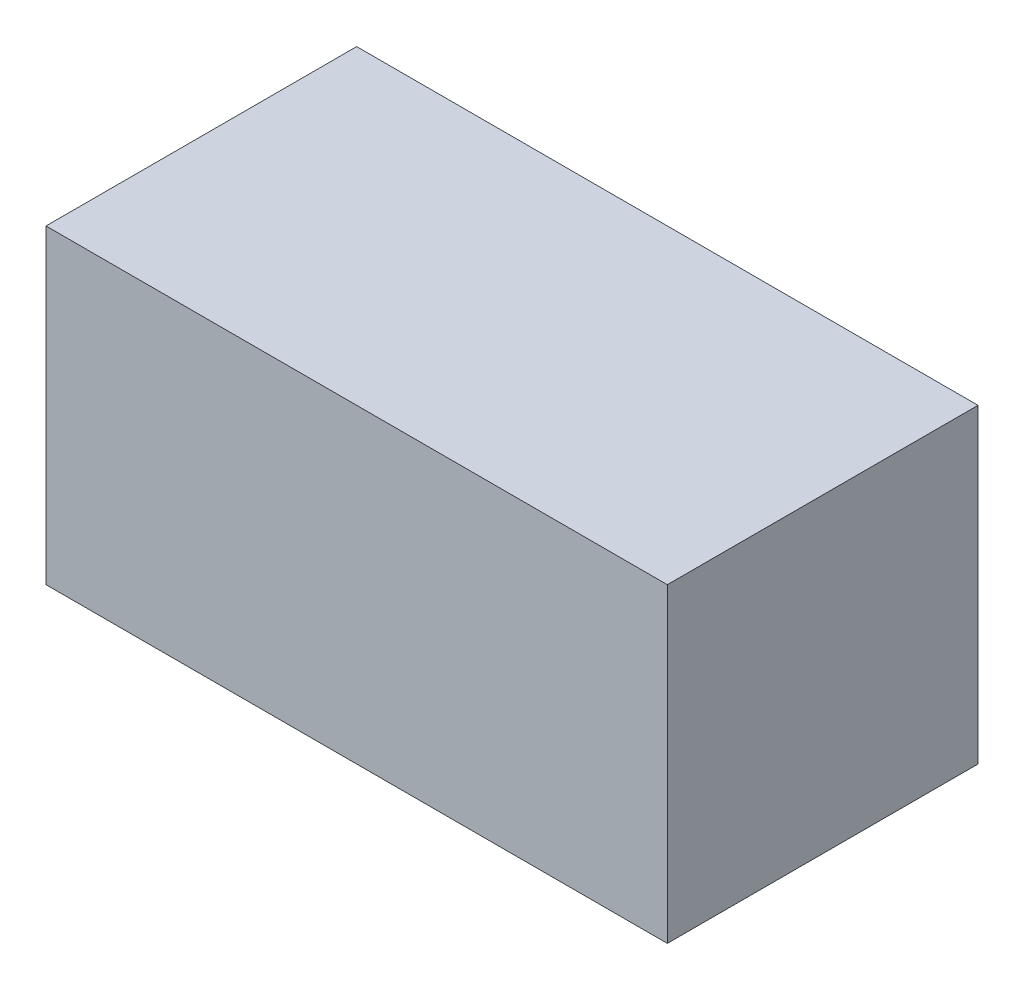
ISO-10303-21;
HEADER;
FILE_DESCRIPTION(('STEP AP214'),'2;1');
FILE_NAME('part.step','',(''),(''),'','','');
FILE_SCHEMA(('AUTOMOTIVE_DESIGN { 1 0 10303 214 1 1 1 1 }'));
ENDSEC;
DATA;
#1=APPLICATION_CONTEXT('core data for automotive mechanical design processes');
#2=APPLICATION_PROTOCOL_DEFINITION('international standard','automotive_design',2000,#1);
#3=PRODUCT_CONTEXT('',#1,'mechanical');
#4=PRODUCT('Part','Part','',(#3));
#5=PRODUCT_RELATED_PRODUCT_CATEGORY('part','',(#4));
#6=PRODUCT_DEFINITION_FORMATION('','',#4);
#7=PRODUCT_DEFINITION_CONTEXT('part definition',#1,'design');
#8=PRODUCT_DEFINITION('design','',#6,#7);
#9=PRODUCT_DEFINITION_SHAPE('','',#8);
#10=(LENGTH_UNIT() NAMED_UNIT(*) SI_UNIT(.MILLI.,.METRE.));
#11=(NAMED_UNIT(*) PLANE_ANGLE_UNIT() SI_UNIT($,.RADIAN.));
#12=(NAMED_UNIT(*) SI_UNIT($,.STERADIAN.) SOLID_ANGLE_UNIT());
#13=UNCERTAINTY_MEASURE_WITH_UNIT(LENGTH_MEASURE(1.E-05),#10,'distance_accuracy_value','');
#14=(GEOMETRIC_REPRESENTATION_CONTEXT(3) GLOBAL_UNCERTAINTY_ASSIGNED_CONTEXT((#13)) GLOBAL_UNIT_ASSIGNED_CONTEXT((#10,
#11,#12)) REPRESENTATION_CONTEXT('',''));
#15=CARTESIAN_POINT('',(0.,0.,0.));
#16=DIRECTION('',(0.,0.,1.));
#17=DIRECTION('',(1.,0.,0.));
#18=AXIS2_PLACEMENT_3D('',#15,#16,#17);
#19=CARTESIAN_POINT('',(-25.4,12.7,0.));
#20=DIRECTION('',(-1.,0.,0.));
#21=DIRECTION('',(0.,0.,1.));
#22=AXIS2_PLACEMENT_3D('',#19,#20,#21);
#23=CYLINDRICAL_SURFACE('',#22,8.92809999999999);
#24=CARTESIAN_POINT('',(12.7,12.7,0.));
#25=DIRECTION('',(-1.,0.,0.));
#26=DIRECTION('',(0.,0.,1.));
#27=AXIS2_PLACEMENT_3D('',#24,#25,#26);
#28=CIRCLE('',#27,8.92809999999999);
#29=CARTESIAN_POINT('',(12.7,12.7,8.92809999999999));
#30=VERTEX_POINT('',#29);
#31=EDGE_CURVE('E103',#30,#30,#28,.T.);
#32=ORIENTED_EDGE('',*,*,#31,.F.);
#33=EDGE_LOOP('',(#32));
#34=FACE_BOUND('',#33,.T.);
#35=CARTESIAN_POINT('',(-25.4,12.7,0.));
#36=DIRECTION('',(-1.,0.,0.));
#37=DIRECTION('',(0.,0.,1.));
#38=AXIS2_PLACEMENT_3D('',#35,#36,#37);
#39=CIRCLE('',#38,8.92809999999999);
#40=CARTESIAN_POINT('',(-25.4,12.7,8.92809999999999));
#41=VERTEX_POINT('',#40);
#42=EDGE_CURVE('E106',#41,#41,#39,.T.);
#43=ORIENTED_EDGE('',*,*,#42,.T.);
#44=EDGE_LOOP('',(#43));
#45=FACE_BOUND('',#44,.T.);
#46=CARTESIAN_POINT('',(10.2181980227004,3.7719,0.));
#47=CARTESIAN_POINT('',(10.2181944214406,3.77190063238409,-0.0556683336668705));
#48=CARTESIAN_POINT('',(10.2131584816779,3.77242757578606,-0.11143084914894));
#49=CARTESIAN_POINT('',(10.1933108112724,3.77447169913876,-0.22124470362191));
#50=CARTESIAN_POINT('',(10.1784742304934,3.77599139616945,-0.275291325804607));
#51=CARTESIAN_POINT('',(10.1400042664043,3.7798291202376,-0.37979419712044));
#52=CARTESIAN_POINT('',(10.1164155417305,3.78214309001127,-0.430267150436529));
#53=CARTESIAN_POINT('',(10.0616650371925,3.78732525556332,-0.526821851535207));
#54=CARTESIAN_POINT('',(10.0305052300792,3.79019330692821,-0.572904738863335));
#55=CARTESIAN_POINT('',(9.95961208877273,3.79643003288304,-0.663015778492222));
#56=CARTESIAN_POINT('',(9.9194433431201,3.79981939724999,-0.706697781355072));
#57=CARTESIAN_POINT('',(9.83347662327802,3.80665615476999,-0.788081854608544));
#58=CARTESIAN_POINT('',(9.7876750806281,3.8101035835019,-0.825780099203117));
#59=CARTESIAN_POINT('',(9.66652350635339,3.81858959300223,-0.913439080845495));
#60=CARTESIAN_POINT('',(9.58828821592064,3.82351293204061,-0.959441674533264));
#61=CARTESIAN_POINT('',(9.42536706096739,3.83238891349735,-1.03827178819262));
#62=CARTESIAN_POINT('',(9.34066675737028,3.83633929455815,-1.07106872560836));
#63=CARTESIAN_POINT('',(9.13996111776713,3.84400174272532,-1.13293963627016));
#64=CARTESIAN_POINT('',(9.02255589303995,3.84723978288066,-1.15752418832547));
#65=CARTESIAN_POINT('',(8.78534871742302,3.85122607060523,-1.18759142775886));
#66=CARTESIAN_POINT('',(8.66554471303138,3.85197208438967,-1.19305697758927));
#67=CARTESIAN_POINT('',(8.42434918717754,3.85104896061993,-1.18618959543074));
#68=CARTESIAN_POINT('',(8.302967489546,3.84933648512519,-1.17353729431445));
#69=CARTESIAN_POINT('',(8.06346616733624,3.843711480731,-1.13031341592124));
#70=CARTESIAN_POINT('',(7.94534567787756,3.83979954113031,-1.09974663834728));
#71=CARTESIAN_POINT('',(7.73659128482036,3.83114410892205,-1.02734025178021));
#72=CARTESIAN_POINT('',(7.64487692059536,3.8266829110703,-0.988578424321593));
#73=CARTESIAN_POINT('',(7.468352362096,3.81702195890096,-0.897651050536718));
#74=CARTESIAN_POINT('',(7.38353043433049,3.81182350293899,-0.845508939739309));
#75=CARTESIAN_POINT('',(7.2512252069586,3.80304148649616,-0.746112174085791));
#76=CARTESIAN_POINT('',(7.20067258348825,3.79949261218142,-0.702947134797188));
#77=CARTESIAN_POINT('',(7.10653723058707,3.79260827577851,-0.60953435542413));
#78=CARTESIAN_POINT('',(7.06294387164364,3.78927249298355,-0.559297641764893));
#79=CARTESIAN_POINT('',(6.99444151384193,3.78387648973479,-0.464137205842773));
#80=CARTESIAN_POINT('',(6.96754229638645,3.78169955710076,-0.420662947933586));
#81=CARTESIAN_POINT('',(6.92109892543249,3.7778816405454,-0.329893783557886));
#82=CARTESIAN_POINT('',(6.90154898302799,3.77624023493324,-0.282601919979492));
#83=CARTESIAN_POINT('',(6.87125338134398,3.77367563062393,-0.184704087016902));
#84=CARTESIAN_POINT('',(6.86059308494411,3.77275939958343,-0.134070912826705));
#85=CARTESIAN_POINT('',(6.84954968710808,3.77181003609868,-0.0316934402759326));
#86=CARTESIAN_POINT('',(6.84915801289889,3.77177616701351,0.020049895139175));
#87=CARTESIAN_POINT('',(6.85797337689614,3.77253427115598,0.115152003022762));
#88=CARTESIAN_POINT('',(6.86580873615962,3.77320823307061,0.158646857903202));
#89=CARTESIAN_POINT('',(6.88837040626906,3.77512724334648,0.243785968170773));
#90=CARTESIAN_POINT('',(6.9030997585414,3.77637254376061,0.285429397875874));
#91=CARTESIAN_POINT('',(6.94376290817023,3.77975585390399,0.37809898647053));
#92=CARTESIAN_POINT('',(6.97172731888871,3.782049285609,0.428224912864161));
#93=CARTESIAN_POINT('',(7.03537025587119,3.78711977326574,0.523272030561854));
#94=CARTESIAN_POINT('',(7.07106324423677,3.78989773397093,0.568183218399807));
#95=CARTESIAN_POINT('',(7.16491524239065,3.79694133583031,0.670977676214066));
#96=CARTESIAN_POINT('',(7.22611266736508,3.80133059600001,0.726065708544852));
#97=CARTESIAN_POINT('',(7.35630770309601,3.81005254557482,0.826026004347087));
#98=CARTESIAN_POINT('',(7.42532127864328,3.81438509827178,0.870876773531388));
#99=CARTESIAN_POINT('',(7.60087680937298,3.82448053761799,0.969323037082382));
#100=CARTESIAN_POINT('',(7.71032299242473,3.83000889995874,1.01776071395671));
#101=CARTESIAN_POINT('',(7.93548532249668,3.83943383039652,1.09676459538807));
#102=CARTESIAN_POINT('',(8.05120857062844,3.8433285049457,1.12731007791592));
#103=CARTESIAN_POINT('',(8.28904632489587,3.84909583862176,1.17174259214398));
#104=CARTESIAN_POINT('',(8.41124895693365,3.85091196040067,1.18516492891868));
#105=CARTESIAN_POINT('',(8.65627532905807,3.85201507892178,1.19338232709999));
#106=CARTESIAN_POINT('',(8.77909861202497,3.85130372455638,1.18818953275509));
#107=CARTESIAN_POINT('',(9.00400981037438,3.8475740114916,1.16003507098491));
#108=CARTESIAN_POINT('',(9.10644856173825,3.84491707344311,1.13985069952418));
#109=CARTESIAN_POINT('',(9.30685039172076,3.83785473850154,1.08359341962211));
#110=CARTESIAN_POINT('',(9.40481910252731,3.83345161364721,1.04754115091573));
#111=CARTESIAN_POINT('',(9.56907333360304,3.824598172528,0.969193701031725));
#112=CARTESIAN_POINT('',(9.63717636790028,3.8204322699563,0.930684661478585));
#113=CARTESIAN_POINT('',(9.76638849420098,3.81171102856006,0.843335259675215));
#114=CARTESIAN_POINT('',(9.82750791774735,3.80715628289977,0.794510471609186));
#115=CARTESIAN_POINT('',(9.92879455028721,3.7990520831796,0.697124632145424));
#116=CARTESIAN_POINT('',(9.97071865210738,3.79548102443904,0.650398586032248));
#117=CARTESIAN_POINT('',(10.0464062231168,3.78875531678881,0.550619189482499));
#118=CARTESIAN_POINT('',(10.0801679687181,3.78560075589181,0.49756450619773));
#119=CARTESIAN_POINT('',(10.1378683157981,3.78005664053273,0.385669608497829));
#120=CARTESIAN_POINT('',(10.1617162758814,3.77767418713064,0.326781854184088));
#121=CARTESIAN_POINT('',(10.1973943279455,3.77406210118322,0.205534923023803));
#122=CARTESIAN_POINT('',(10.2092655680408,3.77282852260852,0.143188413787246));
#123=CARTESIAN_POINT('',(10.2158763667304,3.77214149212562,0.0670413806723153));
#124=CARTESIAN_POINT('',(10.2167459133633,3.77205111744866,0.053649614265323));
#125=CARTESIAN_POINT('',(10.2179071769543,3.77193029499603,0.0268403905813812));
#126=CARTESIAN_POINT('',(10.218198891048,3.77189984751746,0.0134229331774018));
#127=CARTESIAN_POINT('',(10.2181980227004,3.7719,0.));
#128=B_SPLINE_CURVE_WITH_KNOTS('',3,(#46,#47,#48,#49,#50,#51,#52,#53,#54,#55,#56,#57,#58,#59,
#60,#61,#62,#63,#64,#65,#66,#67,#68,#69,#70,#71,#72,#73,#74,#75,#76,#77,#78,#79,#80,#81,#82,#83,
#84,#85,#86,#87,#88,#89,#90,#91,#92,#93,#94,#95,#96,#97,#98,#99,#100,#101,#102,#103,#104,#105,
#106,#107,#108,#109,#110,#111,#112,#113,#114,#115,#116,#117,#118,#119,#120,#121,#122,#123,#124,
#125,#126,#127),.UNSPECIFIED.,.T.,.F.,(4,2,2,2,2,2,2,2,2,2,2,2,2,2,2,2,2,2,2,2,2,2,2,2,2,2,2,2,
2,2,2,2,2,2,2,2,2,2,2,2,4),(0.,0.166945997373098,0.334316929951343,0.500845325556633,
0.667330376315998,0.845002582595464,1.02278793234266,1.29394554676624,1.56572756369134,
1.92381414009826,2.28222160958436,2.64702515411579,3.0117310039845,3.30983861062955,
3.60742760466136,3.80656867494322,4.00540260720464,4.15834943479464,4.31117553492601,
4.46545278026866,4.61960122294067,4.75159151575459,4.88364009375865,5.05502359724948,
5.22673061719812,5.47273239845186,5.7192460319277,6.07677388884192,6.43471500577519,
6.80217671764646,7.16939874632926,7.48163006517695,7.79345645235816,8.02768473430977,
8.26156188560914,8.44946247389705,8.63740270525526,8.82702535954132,9.01599429047224,
9.05624866329867,9.09650323568059),.UNSPECIFIED.);
#129=CARTESIAN_POINT('',(10.2181980227004,3.7719,0.));
#130=VERTEX_POINT('',#129);
#131=EDGE_CURVE('E41',#130,#130,#128,.T.);
#132=ORIENTED_EDGE('',*,*,#131,.F.);
#133=EDGE_LOOP('',(#132));
#134=FACE_BOUND('',#133,.T.);
#135=ADVANCED_FACE('F37',(#34,#45,#134),#23,.F.);
#136=CARTESIAN_POINT('',(25.4,25.4,12.7));
#137=DIRECTION('',(-1.,0.,0.));
#138=DIRECTION('',(0.,0.,1.));
#139=AXIS2_PLACEMENT_3D('',#136,#137,#138);
#140=PLANE('',#139);
#141=DIRECTION('',(0.,0.,-1.));
#142=VECTOR('',#141,1.);
#143=CARTESIAN_POINT('',(25.4,0.,12.7));
#144=LINE('',#143,#142);
#145=CARTESIAN_POINT('',(25.4,0.,12.7));
#146=VERTEX_POINT('',#145);
#147=CARTESIAN_POINT('',(25.4,0.,-12.7));
#148=VERTEX_POINT('',#147);
#149=EDGE_CURVE('E105',#146,#148,#144,.T.);
#150=ORIENTED_EDGE('',*,*,#149,.T.);
#151=DIRECTION('',(0.,-1.,0.));
#152=VECTOR('',#151,1.);
#153=CARTESIAN_POINT('',(25.4,25.4,-12.7));
#154=LINE('',#153,#152);
#155=CARTESIAN_POINT('',(25.4,25.4,-12.7));
#156=VERTEX_POINT('',#155);
#157=EDGE_CURVE('E11',#156,#148,#154,.T.);
#158=ORIENTED_EDGE('',*,*,#157,.F.);
#159=DIRECTION('',(0.,0.,-1.));
#160=VECTOR('',#159,1.);
#161=CARTESIAN_POINT('',(25.4,25.4,12.7));
#162=LINE('',#161,#160);
#163=CARTESIAN_POINT('',(25.4,25.4,12.7));
#164=VERTEX_POINT('',#163);
#165=EDGE_CURVE('E116',#164,#156,#162,.T.);
#166=ORIENTED_EDGE('',*,*,#165,.F.);
#167=DIRECTION('',(0.,-1.,0.));
#168=VECTOR('',#167,1.);
#169=CARTESIAN_POINT('',(25.4,25.4,12.7));
#170=LINE('',#169,#168);
#171=EDGE_CURVE('E121',#164,#146,#170,.T.);
#172=ORIENTED_EDGE('',*,*,#171,.T.);
#173=EDGE_LOOP('',(#150,#158,#166,#172));
#174=FACE_BOUND('',#173,.T.);
#175=ADVANCED_FACE('F39',(#174),#140,.F.);
#176=CARTESIAN_POINT('',(-25.4,25.4,-12.7));
#177=DIRECTION('',(0.,0.,1.));
#178=DIRECTION('',(1.,0.,0.));
#179=AXIS2_PLACEMENT_3D('',#176,#177,#178);
#180=PLANE('',#179);
#181=DIRECTION('',(-1.,0.,0.));
#182=VECTOR('',#181,1.);
#183=CARTESIAN_POINT('',(-25.4,0.,-12.7));
#184=LINE('',#183,#182);
#185=CARTESIAN_POINT('',(-25.4,0.,-12.7));
#186=VERTEX_POINT('',#185);
#187=EDGE_CURVE('E109',#148,#186,#184,.T.);
#188=ORIENTED_EDGE('',*,*,#187,.T.);
#189=DIRECTION('',(0.,-1.,0.));
#190=VECTOR('',#189,1.);
#191=CARTESIAN_POINT('',(-25.4,25.4,-12.7));
#192=LINE('',#191,#190);
#193=CARTESIAN_POINT('',(-25.4,25.4,-12.7));
#194=VERTEX_POINT('',#193);
#195=EDGE_CURVE('E52',#194,#186,#192,.T.);
#196=ORIENTED_EDGE('',*,*,#195,.F.);
#197=DIRECTION('',(-1.,0.,0.));
#198=VECTOR('',#197,1.);
#199=CARTESIAN_POINT('',(-25.4,25.4,-12.7));
#200=LINE('',#199,#198);
#201=EDGE_CURVE('E91',#156,#194,#200,.T.);
#202=ORIENTED_EDGE('',*,*,#201,.F.);
#203=ORIENTED_EDGE('',*,*,#157,.T.);
#204=EDGE_LOOP('',(#188,#196,#202,#203));
#205=FACE_BOUND('',#204,.T.);
#206=ADVANCED_FACE('F145',(#205),#180,.F.);
#207=CARTESIAN_POINT('',(-25.4,25.4,12.7));
#208=DIRECTION('',(1.,0.,0.));
#209=DIRECTION('',(0.,0.,-1.));
#210=AXIS2_PLACEMENT_3D('',#207,#208,#209);
#211=PLANE('',#210);
#212=ORIENTED_EDGE('',*,*,#42,.F.);
#213=EDGE_LOOP('',(#212));
#214=FACE_BOUND('',#213,.T.);
#215=DIRECTION('',(0.,0.,1.));
#216=VECTOR('',#215,1.);
#217=CARTESIAN_POINT('',(-25.4,0.,12.7));
#218=LINE('',#217,#216);
#219=CARTESIAN_POINT('',(-25.4,0.,12.7));
#220=VERTEX_POINT('',#219);
#221=EDGE_CURVE('E78',#186,#220,#218,.T.);
#222=ORIENTED_EDGE('',*,*,#221,.T.);
#223=DIRECTION('',(0.,-1.,0.));
#224=VECTOR('',#223,1.);
#225=CARTESIAN_POINT('',(-25.4,25.4,12.7));
#226=LINE('',#225,#224);
#227=CARTESIAN_POINT('',(-25.4,25.4,12.7));
#228=VERTEX_POINT('',#227);
#229=EDGE_CURVE('E127',#228,#220,#226,.T.);
#230=ORIENTED_EDGE('',*,*,#229,.F.);
#231=DIRECTION('',(0.,0.,1.));
#232=VECTOR('',#231,1.);
#233=CARTESIAN_POINT('',(-25.4,25.4,12.7));
#234=LINE('',#233,#232);
#235=EDGE_CURVE('E119',#194,#228,#234,.T.);
#236=ORIENTED_EDGE('',*,*,#235,.F.);
#237=ORIENTED_EDGE('',*,*,#195,.T.);
#238=EDGE_LOOP('',(#222,#230,#236,#237));
#239=FACE_BOUND('',#238,.T.);
#240=ADVANCED_FACE('F130',(#214,#239),#211,.F.);
#241=CARTESIAN_POINT('',(-25.4,25.4,12.7));
#242=DIRECTION('',(0.,0.,-1.));
#243=DIRECTION('',(-1.,0.,0.));
#244=AXIS2_PLACEMENT_3D('',#241,#242,#243);
#245=PLANE('',#244);
#246=DIRECTION('',(1.,0.,0.));
#247=VECTOR('',#246,1.);
#248=CARTESIAN_POINT('',(-25.4,0.,12.7));
#249=LINE('',#248,#247);
#250=EDGE_CURVE('E84',#220,#146,#249,.T.);
#251=ORIENTED_EDGE('',*,*,#250,.T.);
#252=ORIENTED_EDGE('',*,*,#171,.F.);
#253=DIRECTION('',(1.,0.,0.));
#254=VECTOR('',#253,1.);
#255=CARTESIAN_POINT('',(-25.4,25.4,12.7));
#256=LINE('',#255,#254);
#257=EDGE_CURVE('E60',#228,#164,#256,.T.);
#258=ORIENTED_EDGE('',*,*,#257,.F.);
#259=ORIENTED_EDGE('',*,*,#229,.T.);
#260=EDGE_LOOP('',(#251,#252,#258,#259));
#261=FACE_BOUND('',#260,.T.);
#262=ADVANCED_FACE('F136',(#261),#245,.F.);
#263=CARTESIAN_POINT('',(0.,25.4,0.));
#264=DIRECTION('',(0.,-1.,0.));
#265=DIRECTION('',(0.,0.,-1.));
#266=AXIS2_PLACEMENT_3D('',#263,#264,#265);
#267=PLANE('',#266);
#268=ORIENTED_EDGE('',*,*,#165,.T.);
#269=ORIENTED_EDGE('',*,*,#201,.T.);
#270=ORIENTED_EDGE('',*,*,#235,.T.);
#271=ORIENTED_EDGE('',*,*,#257,.T.);
#272=EDGE_LOOP('',(#268,#269,#270,#271));
#273=FACE_BOUND('',#272,.T.);
#274=ADVANCED_FACE('F138',(#273),#267,.F.);
#275=CARTESIAN_POINT('',(0.,0.,0.));
#276=DIRECTION('',(0.,-1.,0.));
#277=DIRECTION('',(0.,0.,-1.));
#278=AXIS2_PLACEMENT_3D('',#275,#276,#277);
#279=PLANE('',#278);
#280=CARTESIAN_POINT('',(4.76249999999995,0.,0.));
#281=DIRECTION('',(0.,-1.,0.));
#282=DIRECTION('',(-1.,0.,0.));
#283=AXIS2_PLACEMENT_3D('',#280,#281,#282);
#284=ELLIPSE('',#283,1.68379802270045,1.190625);
#285=CARTESIAN_POINT('',(3.0787019772995,0.,0.));
#286=VERTEX_POINT('',#285);
#287=EDGE_CURVE('E112',#286,#286,#284,.F.);
#288=ORIENTED_EDGE('',*,*,#287,.T.);
#289=EDGE_LOOP('',(#288));
#290=FACE_BOUND('',#289,.T.);
#291=ORIENTED_EDGE('',*,*,#149,.F.);
#292=ORIENTED_EDGE('',*,*,#250,.F.);
#293=ORIENTED_EDGE('',*,*,#221,.F.);
#294=ORIENTED_EDGE('',*,*,#187,.F.);
#295=EDGE_LOOP('',(#291,#292,#293,#294));
#296=FACE_BOUND('',#295,.T.);
#297=ADVANCED_FACE('F99',(#290,#296),#279,.T.);
#298=CARTESIAN_POINT('',(12.7,12.7,0.));
#299=DIRECTION('',(-1.,0.,0.));
#300=DIRECTION('',(0.,0.,1.));
#301=AXIS2_PLACEMENT_3D('',#298,#299,#300);
#302=CONICAL_SURFACE('',#301,8.92809999999999,1.02974425867665);
#303=CARTESIAN_POINT('',(18.0645436927399,12.7,0.));
#304=VERTEX_POINT('',#303);
#305=VERTEX_LOOP('',#304);
#306=FACE_BOUND('',#305,.T.);
#307=ORIENTED_EDGE('',*,*,#31,.T.);
#308=EDGE_LOOP('',(#307));
#309=FACE_BOUND('',#308,.T.);
#310=ADVANCED_FACE('F95',(#306,#309),#302,.F.);
#311=CARTESIAN_POINT('',(-9.3521893932622,-14.1146893932623,0.));
#312=DIRECTION('',(-0.707106781186544,-0.707106781186552,0.));
#313=DIRECTION('',(0.707106781186552,-0.707106781186544,0.));
#314=AXIS2_PLACEMENT_3D('',#311,#312,#313);
#315=CYLINDRICAL_SURFACE('',#314,1.190625);
#316=ORIENTED_EDGE('',*,*,#287,.F.);
#317=EDGE_LOOP('',(#316));
#318=FACE_BOUND('',#317,.T.);
#319=ORIENTED_EDGE('',*,*,#131,.T.);
#320=EDGE_LOOP('',(#319));
#321=FACE_BOUND('',#320,.T.);
#322=ADVANCED_FACE('F98',(#318,#321),#315,.F.);
#323=CLOSED_SHELL('',(#135,#175,#206,#240,#262,#274,#297,#310,#322));
#324=MANIFOLD_SOLID_BREP('B2',#323);
#325=ADVANCED_BREP_SHAPE_REPRESENTATION('',(#18,#324),#14);
#326=SHAPE_DEFINITION_REPRESENTATION(#9,#325);
ENDSEC;
END-ISO-10303-21;
